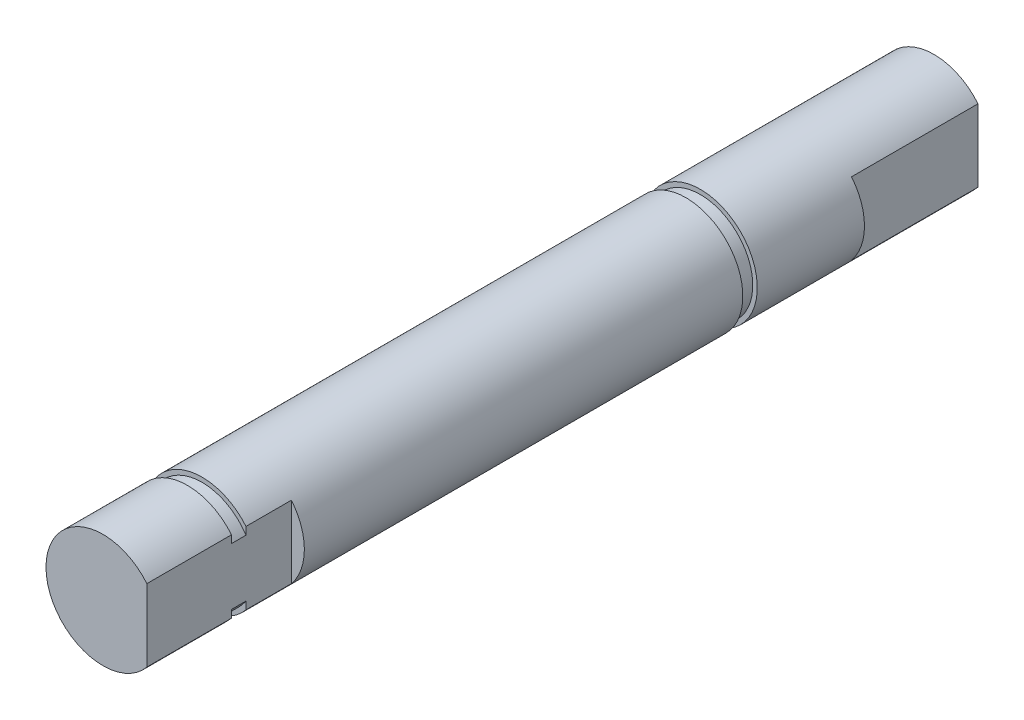
ISO-10303-21;
HEADER;
FILE_DESCRIPTION(('STEP AP214'),'2;1');
FILE_NAME('part.step','',(''),(''),'','','');
FILE_SCHEMA(('AUTOMOTIVE_DESIGN { 1 0 10303 214 1 1 1 1 }'));
ENDSEC;
DATA;
#1=APPLICATION_CONTEXT('core data for automotive mechanical design processes');
#2=APPLICATION_PROTOCOL_DEFINITION('international standard','automotive_design',2000,#1);
#3=PRODUCT_CONTEXT('',#1,'mechanical');
#4=PRODUCT('Part','Part','',(#3));
#5=PRODUCT_RELATED_PRODUCT_CATEGORY('part','',(#4));
#6=PRODUCT_DEFINITION_FORMATION('','',#4);
#7=PRODUCT_DEFINITION_CONTEXT('part definition',#1,'design');
#8=PRODUCT_DEFINITION('design','',#6,#7);
#9=PRODUCT_DEFINITION_SHAPE('','',#8);
#10=(LENGTH_UNIT() NAMED_UNIT(*) SI_UNIT(.MILLI.,.METRE.));
#11=(NAMED_UNIT(*) PLANE_ANGLE_UNIT() SI_UNIT($,.RADIAN.));
#12=(NAMED_UNIT(*) SI_UNIT($,.STERADIAN.) SOLID_ANGLE_UNIT());
#13=UNCERTAINTY_MEASURE_WITH_UNIT(LENGTH_MEASURE(1.E-05),#10,'distance_accuracy_value','');
#14=(GEOMETRIC_REPRESENTATION_CONTEXT(3) GLOBAL_UNCERTAINTY_ASSIGNED_CONTEXT((#13)) GLOBAL_UNIT_ASSIGNED_CONTEXT((#10,
#11,#12)) REPRESENTATION_CONTEXT('',''));
#15=CARTESIAN_POINT('',(0.,0.,0.));
#16=DIRECTION('',(0.,0.,1.));
#17=DIRECTION('',(1.,0.,0.));
#18=AXIS2_PLACEMENT_3D('',#15,#16,#17);
#19=CARTESIAN_POINT('',(0.,0.,58.42));
#20=DIRECTION('',(0.,0.,-1.));
#21=DIRECTION('',(-1.,0.,0.));
#22=AXIS2_PLACEMENT_3D('',#19,#20,#21);
#23=CYLINDRICAL_SURFACE('',#22,4.000000001);
#24=CARTESIAN_POINT('',(0.,0.,17.439386));
#25=DIRECTION('',(0.,0.,-1.));
#26=DIRECTION('',(-1.,0.,0.));
#27=AXIS2_PLACEMENT_3D('',#24,#25,#26);
#28=CIRCLE('',#27,4.000000001);
#29=CARTESIAN_POINT('',(-4.000000001,0.,17.439386));
#30=VERTEX_POINT('',#29);
#31=EDGE_CURVE('E127',#30,#30,#28,.T.);
#32=ORIENTED_EDGE('',*,*,#31,.F.);
#33=EDGE_LOOP('',(#32));
#34=FACE_BOUND('',#33,.T.);
#35=CARTESIAN_POINT('',(0.,0.,51.45405));
#36=DIRECTION('',(0.,0.,1.));
#37=DIRECTION('',(1.,0.,0.));
#38=AXIS2_PLACEMENT_3D('',#35,#36,#37);
#39=CIRCLE('',#38,4.000000001);
#40=CARTESIAN_POINT('',(3.0900485446025,2.54,51.45405));
#41=VERTEX_POINT('',#40);
#42=CARTESIAN_POINT('',(3.0900485446025,-2.54,51.45405));
#43=VERTEX_POINT('',#42);
#44=EDGE_CURVE('E167',#41,#43,#39,.T.);
#45=ORIENTED_EDGE('',*,*,#44,.F.);
#46=DIRECTION('',(0.,0.,1.));
#47=VECTOR('',#46,1.);
#48=CARTESIAN_POINT('',(3.0900485446025,2.54,48.26));
#49=LINE('',#48,#47);
#50=CARTESIAN_POINT('',(3.0900485446025,2.54,48.26));
#51=VERTEX_POINT('',#50);
#52=EDGE_CURVE('E124',#51,#41,#49,.T.);
#53=ORIENTED_EDGE('',*,*,#52,.F.);
#54=CARTESIAN_POINT('',(0.,0.,48.26));
#55=DIRECTION('',(0.,0.,1.));
#56=DIRECTION('',(1.,0.,0.));
#57=AXIS2_PLACEMENT_3D('',#54,#55,#56);
#58=CIRCLE('',#57,4.000000001);
#59=CARTESIAN_POINT('',(3.0900485446025,-2.54,48.26));
#60=VERTEX_POINT('',#59);
#61=EDGE_CURVE('E149',#60,#51,#58,.T.);
#62=ORIENTED_EDGE('',*,*,#61,.F.);
#63=DIRECTION('',(0.,0.,1.));
#64=VECTOR('',#63,1.);
#65=CARTESIAN_POINT('',(3.0900485446025,-2.54,48.26));
#66=LINE('',#65,#64);
#67=EDGE_CURVE('E138',#60,#43,#66,.T.);
#68=ORIENTED_EDGE('',*,*,#67,.T.);
#69=EDGE_LOOP('',(#45,#53,#62,#68));
#70=FACE_BOUND('',#69,.T.);
#71=ADVANCED_FACE('F37',(#34,#70),#23,.T.);
#72=CARTESIAN_POINT('',(3.0900485446025,2.54,48.26));
#73=DIRECTION('',(-1.,0.,0.));
#74=DIRECTION('',(0.,0.,1.));
#75=AXIS2_PLACEMENT_3D('',#72,#73,#74);
#76=PLANE('',#75);
#77=DIRECTION('',(0.,1.,0.));
#78=VECTOR('',#77,1.);
#79=CARTESIAN_POINT('',(3.0900485446025,2.54,51.45405));
#80=LINE('',#79,#78);
#81=CARTESIAN_POINT('',(3.0900485446025,-2.0040182114941,51.45405));
#82=VERTEX_POINT('',#81);
#83=EDGE_CURVE('E12',#43,#82,#80,.T.);
#84=ORIENTED_EDGE('',*,*,#83,.F.);
#85=ORIENTED_EDGE('',*,*,#67,.F.);
#86=DIRECTION('',(0.,-1.,0.));
#87=VECTOR('',#86,1.);
#88=CARTESIAN_POINT('',(3.0900485446025,2.54,48.26));
#89=LINE('',#88,#87);
#90=EDGE_CURVE('E151',#51,#60,#89,.T.);
#91=ORIENTED_EDGE('',*,*,#90,.F.);
#92=ORIENTED_EDGE('',*,*,#52,.T.);
#93=CARTESIAN_POINT('',(3.0900485446025,2.0040182114941,51.45405));
#94=VERTEX_POINT('',#93);
#95=EDGE_CURVE('E47',#94,#41,#80,.T.);
#96=ORIENTED_EDGE('',*,*,#95,.F.);
#97=DIRECTION('',(0.,0.,1.));
#98=VECTOR('',#97,1.);
#99=CARTESIAN_POINT('',(3.0900485446025,2.0040182114941,51.45405));
#100=LINE('',#99,#98);
#101=CARTESIAN_POINT('',(3.0900485446025,2.0040182114941,52.47005));
#102=VERTEX_POINT('',#101);
#103=EDGE_CURVE('E103',#102,#94,#100,.F.);
#104=ORIENTED_EDGE('',*,*,#103,.F.);
#105=DIRECTION('',(0.,1.,0.));
#106=VECTOR('',#105,1.);
#107=CARTESIAN_POINT('',(3.0900485446025,2.54,52.47005));
#108=LINE('',#107,#106);
#109=CARTESIAN_POINT('',(3.0900485446025,2.54,52.47005));
#110=VERTEX_POINT('',#109);
#111=EDGE_CURVE('E111',#102,#110,#108,.T.);
#112=ORIENTED_EDGE('',*,*,#111,.T.);
#113=CARTESIAN_POINT('',(3.0900485446025,2.54,58.42));
#114=VERTEX_POINT('',#113);
#115=EDGE_CURVE('E143',#110,#114,#49,.T.);
#116=ORIENTED_EDGE('',*,*,#115,.T.);
#117=DIRECTION('',(0.,-1.,0.));
#118=VECTOR('',#117,1.);
#119=CARTESIAN_POINT('',(3.0900485446025,2.54,58.42));
#120=LINE('',#119,#118);
#121=CARTESIAN_POINT('',(3.0900485446025,-2.54,58.42));
#122=VERTEX_POINT('',#121);
#123=EDGE_CURVE('E146',#114,#122,#120,.T.);
#124=ORIENTED_EDGE('',*,*,#123,.T.);
#125=CARTESIAN_POINT('',(3.0900485446025,-2.54,52.47005));
#126=VERTEX_POINT('',#125);
#127=EDGE_CURVE('E142',#126,#122,#66,.T.);
#128=ORIENTED_EDGE('',*,*,#127,.F.);
#129=CARTESIAN_POINT('',(3.0900485446025,-2.0040182114941,52.47005));
#130=VERTEX_POINT('',#129);
#131=EDGE_CURVE('E46',#126,#130,#108,.T.);
#132=ORIENTED_EDGE('',*,*,#131,.T.);
#133=DIRECTION('',(0.,0.,1.));
#134=VECTOR('',#133,1.);
#135=CARTESIAN_POINT('',(3.0900485446025,-2.0040182114941,51.45405));
#136=LINE('',#135,#134);
#137=EDGE_CURVE('E41',#82,#130,#136,.T.);
#138=ORIENTED_EDGE('',*,*,#137,.F.);
#139=EDGE_LOOP('',(#84,#85,#91,#92,#96,#104,#112,#116,#124,#128,#132,#138));
#140=FACE_BOUND('',#139,.T.);
#141=ADVANCED_FACE('F121',(#140),#76,.F.);
#142=ORIENTED_EDGE('',*,*,#115,.F.);
#143=CARTESIAN_POINT('',(0.,0.,52.47005));
#144=DIRECTION('',(0.,0.,1.));
#145=DIRECTION('',(1.,0.,0.));
#146=AXIS2_PLACEMENT_3D('',#143,#144,#145);
#147=CIRCLE('',#146,4.000000001);
#148=EDGE_CURVE('E118',#110,#126,#147,.T.);
#149=ORIENTED_EDGE('',*,*,#148,.T.);
#150=ORIENTED_EDGE('',*,*,#127,.T.);
#151=CARTESIAN_POINT('',(0.,0.,58.42));
#152=DIRECTION('',(0.,0.,1.));
#153=DIRECTION('',(1.,0.,0.));
#154=AXIS2_PLACEMENT_3D('',#151,#152,#153);
#155=CIRCLE('',#154,4.000000001);
#156=EDGE_CURVE('E112',#114,#122,#155,.T.);
#157=ORIENTED_EDGE('',*,*,#156,.F.);
#158=EDGE_LOOP('',(#142,#149,#150,#157));
#159=FACE_BOUND('',#158,.T.);
#160=ADVANCED_FACE('F181',(#159),#23,.T.);
#161=CARTESIAN_POINT('',(0.,0.,58.42));
#162=DIRECTION('',(0.,0.,1.));
#163=DIRECTION('',(1.,0.,0.));
#164=AXIS2_PLACEMENT_3D('',#161,#162,#163);
#165=PLANE('',#164);
#166=ORIENTED_EDGE('',*,*,#123,.F.);
#167=ORIENTED_EDGE('',*,*,#156,.T.);
#168=EDGE_LOOP('',(#166,#167));
#169=FACE_BOUND('',#168,.T.);
#170=ADVANCED_FACE('F183',(#169),#165,.T.);
#171=CARTESIAN_POINT('',(0.,0.,48.26));
#172=DIRECTION('',(0.,0.,1.));
#173=DIRECTION('',(1.,0.,0.));
#174=AXIS2_PLACEMENT_3D('',#171,#172,#173);
#175=PLANE('',#174);
#176=ORIENTED_EDGE('',*,*,#61,.T.);
#177=ORIENTED_EDGE('',*,*,#90,.T.);
#178=EDGE_LOOP('',(#176,#177));
#179=FACE_BOUND('',#178,.T.);
#180=ADVANCED_FACE('F185',(#179),#175,.T.);
#181=CARTESIAN_POINT('',(0.,0.,17.439386));
#182=DIRECTION('',(0.,0.,-1.));
#183=DIRECTION('',(-1.,0.,0.));
#184=AXIS2_PLACEMENT_3D('',#181,#182,#183);
#185=PLANE('',#184);
#186=CARTESIAN_POINT('',(0.,0.,17.439386));
#187=DIRECTION('',(0.,0.,-1.));
#188=DIRECTION('',(-1.,0.,0.));
#189=AXIS2_PLACEMENT_3D('',#186,#187,#188);
#190=CIRCLE('',#189,3.683);
#191=CARTESIAN_POINT('',(-3.683,0.,17.439386));
#192=VERTEX_POINT('',#191);
#193=EDGE_CURVE('E134',#192,#192,#190,.T.);
#194=ORIENTED_EDGE('',*,*,#193,.F.);
#195=EDGE_LOOP('',(#194));
#196=FACE_BOUND('',#195,.T.);
#197=ORIENTED_EDGE('',*,*,#31,.T.);
#198=EDGE_LOOP('',(#197));
#199=FACE_BOUND('',#198,.T.);
#200=ADVANCED_FACE('F191',(#196,#199),#185,.T.);
#201=CARTESIAN_POINT('',(0.,0.,16.423386));
#202=DIRECTION('',(0.,0.,-1.));
#203=DIRECTION('',(-1.,0.,0.));
#204=AXIS2_PLACEMENT_3D('',#201,#202,#203);
#205=PLANE('',#204);
#206=CARTESIAN_POINT('',(0.,0.,16.423386));
#207=DIRECTION('',(0.,0.,-1.));
#208=DIRECTION('',(-1.,0.,0.));
#209=AXIS2_PLACEMENT_3D('',#206,#207,#208);
#210=CIRCLE('',#209,3.683);
#211=CARTESIAN_POINT('',(-3.683,0.,16.423386));
#212=VERTEX_POINT('',#211);
#213=EDGE_CURVE('E164',#212,#212,#210,.T.);
#214=ORIENTED_EDGE('',*,*,#213,.T.);
#215=EDGE_LOOP('',(#214));
#216=FACE_BOUND('',#215,.T.);
#217=CARTESIAN_POINT('',(0.,0.,16.423386));
#218=DIRECTION('',(0.,0.,-1.));
#219=DIRECTION('',(-1.,0.,0.));
#220=AXIS2_PLACEMENT_3D('',#217,#218,#219);
#221=CIRCLE('',#220,4.000000001);
#222=CARTESIAN_POINT('',(-4.000000001,0.,16.423386));
#223=VERTEX_POINT('',#222);
#224=EDGE_CURVE('E131',#223,#223,#221,.T.);
#225=ORIENTED_EDGE('',*,*,#224,.F.);
#226=EDGE_LOOP('',(#225));
#227=FACE_BOUND('',#226,.T.);
#228=ADVANCED_FACE('F230',(#216,#227),#205,.F.);
#229=CARTESIAN_POINT('',(0.,0.,17.439386));
#230=DIRECTION('',(0.,0.,-1.));
#231=DIRECTION('',(-1.,0.,0.));
#232=AXIS2_PLACEMENT_3D('',#229,#230,#231);
#233=CYLINDRICAL_SURFACE('',#232,3.683);
#234=ORIENTED_EDGE('',*,*,#193,.T.);
#235=EDGE_LOOP('',(#234));
#236=FACE_BOUND('',#235,.T.);
#237=ORIENTED_EDGE('',*,*,#213,.F.);
#238=EDGE_LOOP('',(#237));
#239=FACE_BOUND('',#238,.T.);
#240=ADVANCED_FACE('F223',(#236,#239),#233,.T.);
#241=CARTESIAN_POINT('',(0.,0.,0.));
#242=DIRECTION('',(0.,0.,1.));
#243=DIRECTION('',(1.,0.,0.));
#244=AXIS2_PLACEMENT_3D('',#241,#242,#243);
#245=PLANE('',#244);
#246=CARTESIAN_POINT('',(0.,0.,0.));
#247=DIRECTION('',(0.,0.,1.));
#248=DIRECTION('',(1.,0.,0.));
#249=AXIS2_PLACEMENT_3D('',#246,#247,#248);
#250=CIRCLE('',#249,4.000000001);
#251=CARTESIAN_POINT('',(3.0900485446025,2.54,0.));
#252=VERTEX_POINT('',#251);
#253=CARTESIAN_POINT('',(3.0900485446025,-2.54,0.));
#254=VERTEX_POINT('',#253);
#255=EDGE_CURVE('E135',#252,#254,#250,.T.);
#256=ORIENTED_EDGE('',*,*,#255,.F.);
#257=DIRECTION('',(0.,1.,0.));
#258=VECTOR('',#257,1.);
#259=CARTESIAN_POINT('',(3.0900485446025,2.54,0.));
#260=LINE('',#259,#258);
#261=EDGE_CURVE('E130',#254,#252,#260,.T.);
#262=ORIENTED_EDGE('',*,*,#261,.F.);
#263=EDGE_LOOP('',(#256,#262));
#264=FACE_BOUND('',#263,.T.);
#265=ADVANCED_FACE('F221',(#264),#245,.F.);
#266=CARTESIAN_POINT('',(3.0900485446025,2.54,8.89));
#267=DIRECTION('',(-1.,0.,0.));
#268=DIRECTION('',(0.,0.,1.));
#269=AXIS2_PLACEMENT_3D('',#266,#267,#268);
#270=PLANE('',#269);
#271=ORIENTED_EDGE('',*,*,#261,.T.);
#272=DIRECTION('',(0.,0.,-1.));
#273=VECTOR('',#272,1.);
#274=CARTESIAN_POINT('',(3.0900485446025,2.54,8.89));
#275=LINE('',#274,#273);
#276=CARTESIAN_POINT('',(3.0900485446025,2.54,8.89));
#277=VERTEX_POINT('',#276);
#278=EDGE_CURVE('E150',#277,#252,#275,.T.);
#279=ORIENTED_EDGE('',*,*,#278,.F.);
#280=DIRECTION('',(0.,1.,0.));
#281=VECTOR('',#280,1.);
#282=CARTESIAN_POINT('',(3.0900485446025,2.54,8.89));
#283=LINE('',#282,#281);
#284=CARTESIAN_POINT('',(3.0900485446025,-2.54,8.89));
#285=VERTEX_POINT('',#284);
#286=EDGE_CURVE('E156',#285,#277,#283,.T.);
#287=ORIENTED_EDGE('',*,*,#286,.F.);
#288=DIRECTION('',(0.,0.,-1.));
#289=VECTOR('',#288,1.);
#290=CARTESIAN_POINT('',(3.0900485446025,-2.54,8.89));
#291=LINE('',#290,#289);
#292=EDGE_CURVE('E62',#285,#254,#291,.T.);
#293=ORIENTED_EDGE('',*,*,#292,.T.);
#294=EDGE_LOOP('',(#271,#279,#287,#293));
#295=FACE_BOUND('',#294,.T.);
#296=ADVANCED_FACE('F213',(#295),#270,.F.);
#297=CARTESIAN_POINT('',(0.,0.,8.89));
#298=DIRECTION('',(0.,0.,-1.));
#299=DIRECTION('',(-1.,0.,0.));
#300=AXIS2_PLACEMENT_3D('',#297,#298,#299);
#301=PLANE('',#300);
#302=CARTESIAN_POINT('',(0.,0.,8.89));
#303=DIRECTION('',(0.,0.,-1.));
#304=DIRECTION('',(-1.,0.,0.));
#305=AXIS2_PLACEMENT_3D('',#302,#303,#304);
#306=CIRCLE('',#305,4.000000001);
#307=EDGE_CURVE('E160',#277,#285,#306,.T.);
#308=ORIENTED_EDGE('',*,*,#307,.T.);
#309=ORIENTED_EDGE('',*,*,#286,.T.);
#310=EDGE_LOOP('',(#308,#309));
#311=FACE_BOUND('',#310,.T.);
#312=ADVANCED_FACE('F205',(#311),#301,.T.);
#313=ORIENTED_EDGE('',*,*,#224,.T.);
#314=EDGE_LOOP('',(#313));
#315=FACE_BOUND('',#314,.T.);
#316=ORIENTED_EDGE('',*,*,#307,.F.);
#317=ORIENTED_EDGE('',*,*,#278,.T.);
#318=ORIENTED_EDGE('',*,*,#255,.T.);
#319=ORIENTED_EDGE('',*,*,#292,.F.);
#320=EDGE_LOOP('',(#316,#317,#318,#319));
#321=FACE_BOUND('',#320,.T.);
#322=ADVANCED_FACE('F39',(#315,#321),#23,.T.);
#323=CARTESIAN_POINT('',(0.,0.,51.45405));
#324=DIRECTION('',(0.,0.,1.));
#325=DIRECTION('',(1.,0.,0.));
#326=AXIS2_PLACEMENT_3D('',#323,#324,#325);
#327=PLANE('',#326);
#328=ORIENTED_EDGE('',*,*,#83,.T.);
#329=CARTESIAN_POINT('',(0.,0.,51.45405));
#330=DIRECTION('',(0.,0.,1.));
#331=DIRECTION('',(1.,0.,0.));
#332=AXIS2_PLACEMENT_3D('',#329,#330,#331);
#333=CIRCLE('',#332,3.683);
#334=EDGE_CURVE('E106',#94,#82,#333,.T.);
#335=ORIENTED_EDGE('',*,*,#334,.F.);
#336=ORIENTED_EDGE('',*,*,#95,.T.);
#337=ORIENTED_EDGE('',*,*,#44,.T.);
#338=EDGE_LOOP('',(#328,#335,#336,#337));
#339=FACE_BOUND('',#338,.T.);
#340=ADVANCED_FACE('F115',(#339),#327,.T.);
#341=CARTESIAN_POINT('',(0.,0.,52.47005));
#342=DIRECTION('',(0.,0.,1.));
#343=DIRECTION('',(1.,0.,0.));
#344=AXIS2_PLACEMENT_3D('',#341,#342,#343);
#345=PLANE('',#344);
#346=ORIENTED_EDGE('',*,*,#148,.F.);
#347=ORIENTED_EDGE('',*,*,#111,.F.);
#348=CARTESIAN_POINT('',(0.,0.,52.47005));
#349=DIRECTION('',(0.,0.,1.));
#350=DIRECTION('',(1.,0.,0.));
#351=AXIS2_PLACEMENT_3D('',#348,#349,#350);
#352=CIRCLE('',#351,3.683);
#353=EDGE_CURVE('E54',#102,#130,#352,.T.);
#354=ORIENTED_EDGE('',*,*,#353,.T.);
#355=ORIENTED_EDGE('',*,*,#131,.F.);
#356=EDGE_LOOP('',(#346,#347,#354,#355));
#357=FACE_BOUND('',#356,.T.);
#358=ADVANCED_FACE('F175',(#357),#345,.F.);
#359=CARTESIAN_POINT('',(0.,0.,51.45405));
#360=DIRECTION('',(0.,0.,1.));
#361=DIRECTION('',(1.,0.,0.));
#362=AXIS2_PLACEMENT_3D('',#359,#360,#361);
#363=CYLINDRICAL_SURFACE('',#362,3.683);
#364=ORIENTED_EDGE('',*,*,#137,.T.);
#365=ORIENTED_EDGE('',*,*,#353,.F.);
#366=ORIENTED_EDGE('',*,*,#103,.T.);
#367=ORIENTED_EDGE('',*,*,#334,.T.);
#368=EDGE_LOOP('',(#364,#365,#366,#367));
#369=FACE_BOUND('',#368,.T.);
#370=ADVANCED_FACE('F105',(#369),#363,.T.);
#371=CLOSED_SHELL('',(#71,#141,#160,#170,#180,#200,#228,#240,#265,#296,#312,#322,#340,#358,#370));
#372=MANIFOLD_SOLID_BREP('B2',#371);
#373=ADVANCED_BREP_SHAPE_REPRESENTATION('',(#18,#372),#14);
#374=SHAPE_DEFINITION_REPRESENTATION(#9,#373);
ENDSEC;
END-ISO-10303-21;
